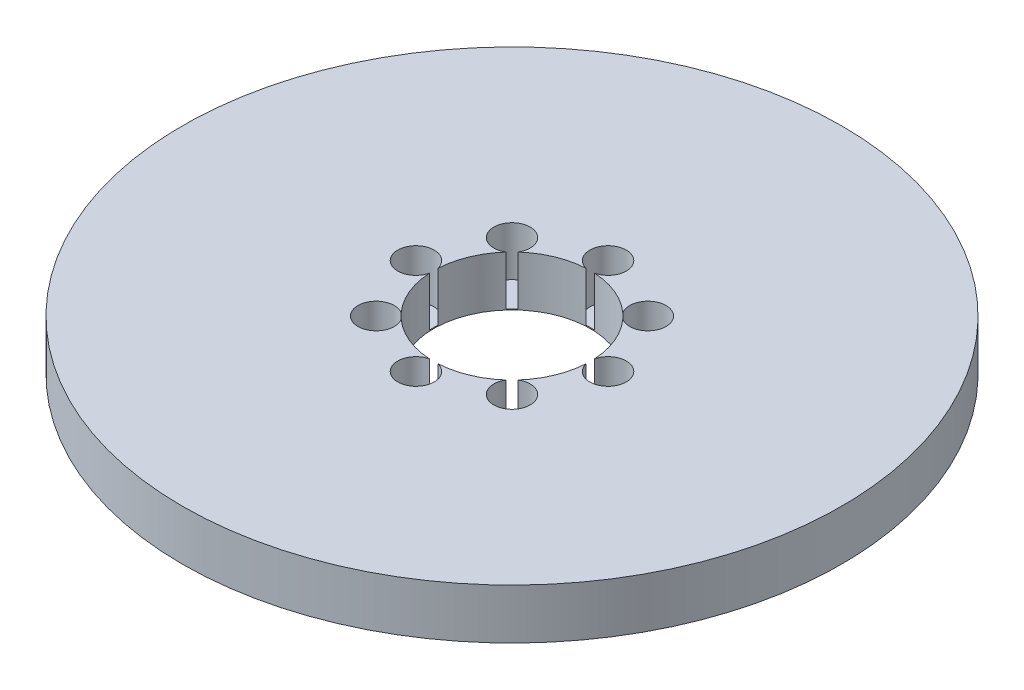
ISO-10303-21;
HEADER;
FILE_DESCRIPTION(('STEP AP214'),'2;1');
FILE_NAME('part.step','',(''),(''),'','','');
FILE_SCHEMA(('AUTOMOTIVE_DESIGN { 1 0 10303 214 1 1 1 1 }'));
ENDSEC;
DATA;
#1=APPLICATION_CONTEXT('core data for automotive mechanical design processes');
#2=APPLICATION_PROTOCOL_DEFINITION('international standard','automotive_design',2000,#1);
#3=PRODUCT_CONTEXT('',#1,'mechanical');
#4=PRODUCT('Part','Part','',(#3));
#5=PRODUCT_RELATED_PRODUCT_CATEGORY('part','',(#4));
#6=PRODUCT_DEFINITION_FORMATION('','',#4);
#7=PRODUCT_DEFINITION_CONTEXT('part definition',#1,'design');
#8=PRODUCT_DEFINITION('design','',#6,#7);
#9=PRODUCT_DEFINITION_SHAPE('','',#8);
#10=(LENGTH_UNIT() NAMED_UNIT(*) SI_UNIT(.MILLI.,.METRE.));
#11=(NAMED_UNIT(*) PLANE_ANGLE_UNIT() SI_UNIT($,.RADIAN.));
#12=(NAMED_UNIT(*) SI_UNIT($,.STERADIAN.) SOLID_ANGLE_UNIT());
#13=UNCERTAINTY_MEASURE_WITH_UNIT(LENGTH_MEASURE(1.E-05),#10,'distance_accuracy_value','');
#14=(GEOMETRIC_REPRESENTATION_CONTEXT(3) GLOBAL_UNCERTAINTY_ASSIGNED_CONTEXT((#13)) GLOBAL_UNIT_ASSIGNED_CONTEXT((#10,
#11,#12)) REPRESENTATION_CONTEXT('',''));
#15=CARTESIAN_POINT('',(0.,0.,0.));
#16=DIRECTION('',(0.,0.,1.));
#17=DIRECTION('',(1.,0.,0.));
#18=AXIS2_PLACEMENT_3D('',#15,#16,#17);
#19=CARTESIAN_POINT('',(0.,8.,0.));
#20=DIRECTION('',(0.,-1.,0.));
#21=DIRECTION('',(0.,0.,-1.));
#22=AXIS2_PLACEMENT_3D('',#19,#20,#21);
#23=CYLINDRICAL_SURFACE('',#22,52.5);
#24=CARTESIAN_POINT('',(0.,8.,0.));
#25=DIRECTION('',(0.,1.,0.));
#26=DIRECTION('',(0.,0.,1.));
#27=AXIS2_PLACEMENT_3D('',#24,#25,#26);
#28=CIRCLE('',#27,52.5);
#29=CARTESIAN_POINT('',(0.,8.,52.5));
#30=VERTEX_POINT('',#29);
#31=EDGE_CURVE('E195',#30,#30,#28,.T.);
#32=ORIENTED_EDGE('',*,*,#31,.F.);
#33=EDGE_LOOP('',(#32));
#34=FACE_BOUND('',#33,.T.);
#35=CARTESIAN_POINT('',(0.,0.,0.));
#36=DIRECTION('',(0.,1.,0.));
#37=DIRECTION('',(0.,0.,1.));
#38=AXIS2_PLACEMENT_3D('',#35,#36,#37);
#39=CIRCLE('',#38,52.5);
#40=CARTESIAN_POINT('',(0.,0.,52.5));
#41=VERTEX_POINT('',#40);
#42=EDGE_CURVE('E179',#41,#41,#39,.T.);
#43=ORIENTED_EDGE('',*,*,#42,.T.);
#44=EDGE_LOOP('',(#43));
#45=FACE_BOUND('',#44,.T.);
#46=ADVANCED_FACE('F39',(#34,#45),#23,.T.);
#47=CARTESIAN_POINT('',(0.,8.,0.));
#48=DIRECTION('',(0.,1.,0.));
#49=DIRECTION('',(0.,0.,1.));
#50=AXIS2_PLACEMENT_3D('',#47,#48,#49);
#51=PLANE('',#50);
#52=CARTESIAN_POINT('',(0.,8.,15.3054688065765));
#53=DIRECTION('',(0.,1.,0.));
#54=DIRECTION('',(1.,0.,0.));
#55=AXIS2_PLACEMENT_3D('',#52,#53,#54);
#56=CIRCLE('',#55,2.89889359926695);
#57=CARTESIAN_POINT('',(-0.65950036807734,8.,12.4825902465997));
#58=VERTEX_POINT('',#57);
#59=CARTESIAN_POINT('',(0.659500368077427,8.,12.4825902465997));
#60=VERTEX_POINT('',#59);
#61=EDGE_CURVE('E176',#58,#60,#56,.T.);
#62=ORIENTED_EDGE('',*,*,#61,.F.);
#63=CARTESIAN_POINT('',(0.,8.,0.));
#64=DIRECTION('',(0.,1.,0.));
#65=DIRECTION('',(0.,0.,1.));
#66=AXIS2_PLACEMENT_3D('',#63,#64,#65);
#67=CIRCLE('',#66,12.5);
#68=CARTESIAN_POINT('',(-8.36018702768115,8.,9.29286139260626));
#69=VERTEX_POINT('',#68);
#70=EDGE_CURVE('E166',#69,#58,#67,.T.);
#71=ORIENTED_EDGE('',*,*,#70,.F.);
#72=CARTESIAN_POINT('',(-10.8226007823694,8.,10.8226007823694));
#73=DIRECTION('',(0.,1.,0.));
#74=DIRECTION('',(0.707106781186549,0.,0.707106781186546));
#75=AXIS2_PLACEMENT_3D('',#72,#73,#74);
#76=CIRCLE('',#75,2.89889359926695);
#77=CARTESIAN_POINT('',(-9.29286139260623,8.,8.36018702768118));
#78=VERTEX_POINT('',#77);
#79=EDGE_CURVE('E147',#78,#69,#76,.T.);
#80=ORIENTED_EDGE('',*,*,#79,.F.);
#81=CARTESIAN_POINT('',(-12.4825902465997,8.,0.659500368077384));
#82=VERTEX_POINT('',#81);
#83=EDGE_CURVE('E180',#82,#78,#67,.T.);
#84=ORIENTED_EDGE('',*,*,#83,.F.);
#85=CARTESIAN_POINT('',(-15.3054688065765,8.,0.));
#86=DIRECTION('',(0.,1.,0.));
#87=DIRECTION('',(0.,0.,1.));
#88=AXIS2_PLACEMENT_3D('',#85,#86,#87);
#89=CIRCLE('',#88,2.89889359926695);
#90=CARTESIAN_POINT('',(-12.4825902465997,8.,-0.659500368077384));
#91=VERTEX_POINT('',#90);
#92=EDGE_CURVE('E186',#91,#82,#89,.T.);
#93=ORIENTED_EDGE('',*,*,#92,.F.);
#94=CARTESIAN_POINT('',(-9.29286139260635,8.,-8.36018702768104));
#95=VERTEX_POINT('',#94);
#96=EDGE_CURVE('E182',#95,#91,#67,.T.);
#97=ORIENTED_EDGE('',*,*,#96,.F.);
#98=CARTESIAN_POINT('',(-10.8226007823695,8.,-10.8226007823693));
#99=DIRECTION('',(0.,1.,0.));
#100=DIRECTION('',(-0.707106781186539,0.,0.707106781186556));
#101=AXIS2_PLACEMENT_3D('',#98,#99,#100);
#102=CIRCLE('',#101,2.89889359926695);
#103=CARTESIAN_POINT('',(-8.36018702768127,8.,-9.29286139260615));
#104=VERTEX_POINT('',#103);
#105=EDGE_CURVE('E446',#104,#95,#102,.T.);
#106=ORIENTED_EDGE('',*,*,#105,.F.);
#107=CARTESIAN_POINT('',(-0.659500368077514,8.,-12.4825902465997));
#108=VERTEX_POINT('',#107);
#109=EDGE_CURVE('E452',#108,#104,#67,.T.);
#110=ORIENTED_EDGE('',*,*,#109,.F.);
#111=CARTESIAN_POINT('',(-1.60316276161223E-13,8.,-15.3054688065765));
#112=DIRECTION('',(0.,1.,0.));
#113=DIRECTION('',(-1.,0.,0.));
#114=AXIS2_PLACEMENT_3D('',#111,#112,#113);
#115=CIRCLE('',#114,2.89889359926695);
#116=CARTESIAN_POINT('',(0.659500368077253,8.,-12.4825902465997));
#117=VERTEX_POINT('',#116);
#118=EDGE_CURVE('E477',#117,#108,#115,.T.);
#119=ORIENTED_EDGE('',*,*,#118,.F.);
#120=CARTESIAN_POINT('',(8.36018702768108,8.,-9.29286139260632));
#121=VERTEX_POINT('',#120);
#122=EDGE_CURVE('E460',#121,#117,#67,.T.);
#123=ORIENTED_EDGE('',*,*,#122,.F.);
#124=CARTESIAN_POINT('',(10.8226007823693,8.,-10.8226007823695));
#125=DIRECTION('',(0.,1.,0.));
#126=DIRECTION('',(-0.707106781186554,0.,-0.707106781186541));
#127=AXIS2_PLACEMENT_3D('',#124,#125,#126);
#128=CIRCLE('',#127,2.89889359926695);
#129=CARTESIAN_POINT('',(9.29286139260617,8.,-8.36018702768124));
#130=VERTEX_POINT('',#129);
#131=EDGE_CURVE('E464',#130,#121,#128,.T.);
#132=ORIENTED_EDGE('',*,*,#131,.F.);
#133=CARTESIAN_POINT('',(12.4825902465997,8.,-0.659500368077384));
#134=VERTEX_POINT('',#133);
#135=EDGE_CURVE('E459',#134,#130,#67,.T.);
#136=ORIENTED_EDGE('',*,*,#135,.F.);
#137=CARTESIAN_POINT('',(15.3054688065765,8.,0.));
#138=DIRECTION('',(0.,1.,0.));
#139=DIRECTION('',(0.,0.,-1.));
#140=AXIS2_PLACEMENT_3D('',#137,#138,#139);
#141=CIRCLE('',#140,2.89889359926695);
#142=CARTESIAN_POINT('',(12.4825902465997,8.,0.659500368077384));
#143=VERTEX_POINT('',#142);
#144=EDGE_CURVE('E469',#143,#134,#141,.T.);
#145=ORIENTED_EDGE('',*,*,#144,.F.);
#146=CARTESIAN_POINT('',(9.2928613926063,8.,8.36018702768111));
#147=VERTEX_POINT('',#146);
#148=EDGE_CURVE('E181',#147,#143,#67,.T.);
#149=ORIENTED_EDGE('',*,*,#148,.F.);
#150=CARTESIAN_POINT('',(10.8226007823695,8.,10.8226007823694));
#151=DIRECTION('',(0.,1.,0.));
#152=DIRECTION('',(0.707106781186544,0.,-0.707106781186551));
#153=AXIS2_PLACEMENT_3D('',#150,#151,#152);
#154=CIRCLE('',#153,2.89889359926695);
#155=CARTESIAN_POINT('',(8.3601870276812,8.,9.29286139260621));
#156=VERTEX_POINT('',#155);
#157=EDGE_CURVE('E475',#156,#147,#154,.T.);
#158=ORIENTED_EDGE('',*,*,#157,.F.);
#159=EDGE_CURVE('E177',#60,#156,#67,.T.);
#160=ORIENTED_EDGE('',*,*,#159,.F.);
#161=EDGE_LOOP('',(#62,#71,#80,#84,#93,#97,#106,#110,#119,#123,#132,#136,#145,#149,#158,#160));
#162=FACE_BOUND('',#161,.T.);
#163=ORIENTED_EDGE('',*,*,#31,.T.);
#164=EDGE_LOOP('',(#163));
#165=FACE_BOUND('',#164,.T.);
#166=ADVANCED_FACE('F172',(#162,#165),#51,.T.);
#167=CARTESIAN_POINT('',(0.,0.,0.));
#168=DIRECTION('',(0.,1.,0.));
#169=DIRECTION('',(0.,0.,1.));
#170=AXIS2_PLACEMENT_3D('',#167,#168,#169);
#171=PLANE('',#170);
#172=CARTESIAN_POINT('',(0.,0.,0.));
#173=DIRECTION('',(0.,1.,0.));
#174=DIRECTION('',(0.,0.,1.));
#175=AXIS2_PLACEMENT_3D('',#172,#173,#174);
#176=CIRCLE('',#175,12.5);
#177=CARTESIAN_POINT('',(0.,0.,12.5));
#178=VERTEX_POINT('',#177);
#179=EDGE_CURVE('E187',#178,#178,#176,.T.);
#180=ORIENTED_EDGE('',*,*,#179,.T.);
#181=EDGE_LOOP('',(#180));
#182=FACE_BOUND('',#181,.T.);
#183=ORIENTED_EDGE('',*,*,#42,.F.);
#184=EDGE_LOOP('',(#183));
#185=FACE_BOUND('',#184,.T.);
#186=ADVANCED_FACE('F270',(#182,#185),#171,.F.);
#187=CARTESIAN_POINT('',(0.,8.,0.));
#188=DIRECTION('',(0.,-1.,0.));
#189=DIRECTION('',(0.,0.,-1.));
#190=AXIS2_PLACEMENT_3D('',#187,#188,#189);
#191=CYLINDRICAL_SURFACE('',#190,12.5);
#192=DIRECTION('',(0.,1.,0.));
#193=VECTOR('',#192,1.);
#194=CARTESIAN_POINT('',(-0.659500368077356,4.07481042956162,12.4825902465997));
#195=LINE('',#194,#193);
#196=CARTESIAN_POINT('',(-0.65950036807734,0.149620859123241,12.4825902465997));
#197=VERTEX_POINT('',#196);
#198=EDGE_CURVE('E11',#197,#58,#195,.T.);
#199=ORIENTED_EDGE('',*,*,#198,.F.);
#200=CARTESIAN_POINT('',(0.,0.149620859123241,0.));
#201=DIRECTION('',(0.,1.,0.));
#202=DIRECTION('',(0.,0.,1.));
#203=AXIS2_PLACEMENT_3D('',#200,#201,#202);
#204=CIRCLE('',#203,12.5);
#205=CARTESIAN_POINT('',(0.659500368077427,0.149620859123241,12.4825902465997));
#206=VERTEX_POINT('',#205);
#207=EDGE_CURVE('E250',#197,#206,#204,.T.);
#208=ORIENTED_EDGE('',*,*,#207,.T.);
#209=DIRECTION('',(0.,1.,0.));
#210=VECTOR('',#209,1.);
#211=CARTESIAN_POINT('',(0.659500368077444,4.07481042956162,12.4825902465997));
#212=LINE('',#211,#210);
#213=EDGE_CURVE('E46',#60,#206,#212,.F.);
#214=ORIENTED_EDGE('',*,*,#213,.F.);
#215=ORIENTED_EDGE('',*,*,#159,.T.);
#216=DIRECTION('',(0.,1.,0.));
#217=VECTOR('',#216,1.);
#218=CARTESIAN_POINT('',(8.3601870276812,4.07481042956162,9.29286139260621));
#219=LINE('',#218,#217);
#220=CARTESIAN_POINT('',(8.3601870276812,0.149620859123241,9.29286139260621));
#221=VERTEX_POINT('',#220);
#222=EDGE_CURVE('E244',#221,#156,#219,.T.);
#223=ORIENTED_EDGE('',*,*,#222,.F.);
#224=CARTESIAN_POINT('',(0.,0.149620859123241,0.));
#225=DIRECTION('',(0.,1.,0.));
#226=DIRECTION('',(0.,0.,1.));
#227=AXIS2_PLACEMENT_3D('',#224,#225,#226);
#228=CIRCLE('',#227,12.5);
#229=CARTESIAN_POINT('',(9.2928613926063,0.149620859123241,8.36018702768111));
#230=VERTEX_POINT('',#229);
#231=EDGE_CURVE('E238',#221,#230,#228,.T.);
#232=ORIENTED_EDGE('',*,*,#231,.T.);
#233=DIRECTION('',(0.,1.,0.));
#234=VECTOR('',#233,1.);
#235=CARTESIAN_POINT('',(9.2928613926063,4.07481042956162,8.3601870276811));
#236=LINE('',#235,#234);
#237=EDGE_CURVE('E242',#147,#230,#236,.F.);
#238=ORIENTED_EDGE('',*,*,#237,.F.);
#239=ORIENTED_EDGE('',*,*,#148,.T.);
#240=DIRECTION('',(0.,1.,0.));
#241=VECTOR('',#240,1.);
#242=CARTESIAN_POINT('',(12.4825902465997,4.07481042956162,0.6595003680774));
#243=LINE('',#242,#241);
#244=CARTESIAN_POINT('',(12.4825902465997,0.149620859123241,0.659500368077384));
#245=VERTEX_POINT('',#244);
#246=EDGE_CURVE('E236',#245,#143,#243,.T.);
#247=ORIENTED_EDGE('',*,*,#246,.F.);
#248=CARTESIAN_POINT('',(0.,0.149620859123241,0.));
#249=DIRECTION('',(0.,1.,0.));
#250=DIRECTION('',(0.,0.,1.));
#251=AXIS2_PLACEMENT_3D('',#248,#249,#250);
#252=CIRCLE('',#251,12.5);
#253=CARTESIAN_POINT('',(12.4825902465997,0.149620859123241,-0.659500368077384));
#254=VERTEX_POINT('',#253);
#255=EDGE_CURVE('E235',#245,#254,#252,.T.);
#256=ORIENTED_EDGE('',*,*,#255,.T.);
#257=DIRECTION('',(0.,1.,0.));
#258=VECTOR('',#257,1.);
#259=CARTESIAN_POINT('',(12.4825902465997,4.07481042956162,-0.6595003680774));
#260=LINE('',#259,#258);
#261=EDGE_CURVE('E234',#134,#254,#260,.F.);
#262=ORIENTED_EDGE('',*,*,#261,.F.);
#263=ORIENTED_EDGE('',*,*,#135,.T.);
#264=DIRECTION('',(0.,1.,0.));
#265=VECTOR('',#264,1.);
#266=CARTESIAN_POINT('',(9.29286139260618,4.07481042956162,-8.36018702768123));
#267=LINE('',#266,#265);
#268=CARTESIAN_POINT('',(9.29286139260617,0.149620859123241,-8.36018702768124));
#269=VERTEX_POINT('',#268);
#270=EDGE_CURVE('E229',#269,#130,#267,.T.);
#271=ORIENTED_EDGE('',*,*,#270,.F.);
#272=CARTESIAN_POINT('',(0.,0.149620859123241,0.));
#273=DIRECTION('',(0.,1.,0.));
#274=DIRECTION('',(0.,0.,1.));
#275=AXIS2_PLACEMENT_3D('',#272,#273,#274);
#276=CIRCLE('',#275,12.5);
#277=CARTESIAN_POINT('',(8.36018702768108,0.149620859123241,-9.29286139260632));
#278=VERTEX_POINT('',#277);
#279=EDGE_CURVE('E221',#269,#278,#276,.T.);
#280=ORIENTED_EDGE('',*,*,#279,.T.);
#281=DIRECTION('',(0.,1.,0.));
#282=VECTOR('',#281,1.);
#283=CARTESIAN_POINT('',(8.36018702768107,4.07481042956162,-9.29286139260633));
#284=LINE('',#283,#282);
#285=EDGE_CURVE('E230',#121,#278,#284,.F.);
#286=ORIENTED_EDGE('',*,*,#285,.F.);
#287=ORIENTED_EDGE('',*,*,#122,.T.);
#288=DIRECTION('',(0.,1.,0.));
#289=VECTOR('',#288,1.);
#290=CARTESIAN_POINT('',(0.659500368077269,4.07481042956162,-12.4825902465997));
#291=LINE('',#290,#289);
#292=CARTESIAN_POINT('',(0.659500368077253,0.149620859123241,-12.4825902465997));
#293=VERTEX_POINT('',#292);
#294=EDGE_CURVE('E225',#293,#117,#291,.T.);
#295=ORIENTED_EDGE('',*,*,#294,.F.);
#296=CARTESIAN_POINT('',(0.,0.149620859123241,0.));
#297=DIRECTION('',(0.,1.,0.));
#298=DIRECTION('',(0.,0.,1.));
#299=AXIS2_PLACEMENT_3D('',#296,#297,#298);
#300=CIRCLE('',#299,12.5);
#301=CARTESIAN_POINT('',(-0.659500368077514,0.149620859123241,-12.4825902465997));
#302=VERTEX_POINT('',#301);
#303=EDGE_CURVE('E216',#293,#302,#300,.T.);
#304=ORIENTED_EDGE('',*,*,#303,.T.);
#305=DIRECTION('',(0.,1.,0.));
#306=VECTOR('',#305,1.);
#307=CARTESIAN_POINT('',(-0.65950036807753,4.07481042956162,-12.4825902465997));
#308=LINE('',#307,#306);
#309=EDGE_CURVE('E218',#108,#302,#308,.F.);
#310=ORIENTED_EDGE('',*,*,#309,.F.);
#311=ORIENTED_EDGE('',*,*,#109,.T.);
#312=DIRECTION('',(0.,1.,0.));
#313=VECTOR('',#312,1.);
#314=CARTESIAN_POINT('',(-8.36018702768127,4.07481042956162,-9.29286139260616));
#315=LINE('',#314,#313);
#316=CARTESIAN_POINT('',(-8.36018702768127,0.149620859123241,-9.29286139260615));
#317=VERTEX_POINT('',#316);
#318=EDGE_CURVE('E212',#317,#104,#315,.T.);
#319=ORIENTED_EDGE('',*,*,#318,.F.);
#320=CARTESIAN_POINT('',(0.,0.149620859123241,0.));
#321=DIRECTION('',(0.,1.,0.));
#322=DIRECTION('',(0.,0.,1.));
#323=AXIS2_PLACEMENT_3D('',#320,#321,#322);
#324=CIRCLE('',#323,12.5);
#325=CARTESIAN_POINT('',(-9.29286139260635,0.149620859123241,-8.36018702768104));
#326=VERTEX_POINT('',#325);
#327=EDGE_CURVE('E208',#317,#326,#324,.T.);
#328=ORIENTED_EDGE('',*,*,#327,.T.);
#329=DIRECTION('',(0.,1.,0.));
#330=VECTOR('',#329,1.);
#331=CARTESIAN_POINT('',(-9.29286139260636,4.07481042956162,-8.36018702768104));
#332=LINE('',#331,#330);
#333=EDGE_CURVE('E211',#95,#326,#332,.F.);
#334=ORIENTED_EDGE('',*,*,#333,.F.);
#335=ORIENTED_EDGE('',*,*,#96,.T.);
#336=DIRECTION('',(0.,1.,0.));
#337=VECTOR('',#336,1.);
#338=CARTESIAN_POINT('',(-12.4825902465997,4.07481042956162,-0.6595003680774));
#339=LINE('',#338,#337);
#340=CARTESIAN_POINT('',(-12.4825902465997,0.149620859123241,-0.659500368077384));
#341=VERTEX_POINT('',#340);
#342=EDGE_CURVE('E201',#341,#91,#339,.T.);
#343=ORIENTED_EDGE('',*,*,#342,.F.);
#344=CARTESIAN_POINT('',(0.,0.149620859123241,0.));
#345=DIRECTION('',(0.,1.,0.));
#346=DIRECTION('',(0.,0.,1.));
#347=AXIS2_PLACEMENT_3D('',#344,#345,#346);
#348=CIRCLE('',#347,12.5);
#349=CARTESIAN_POINT('',(-12.4825902465997,0.149620859123241,0.659500368077384));
#350=VERTEX_POINT('',#349);
#351=EDGE_CURVE('E194',#341,#350,#348,.T.);
#352=ORIENTED_EDGE('',*,*,#351,.T.);
#353=DIRECTION('',(0.,1.,0.));
#354=VECTOR('',#353,1.);
#355=CARTESIAN_POINT('',(-12.4825902465997,4.07481042956162,0.6595003680774));
#356=LINE('',#355,#354);
#357=EDGE_CURVE('E199',#82,#350,#356,.F.);
#358=ORIENTED_EDGE('',*,*,#357,.F.);
#359=ORIENTED_EDGE('',*,*,#83,.T.);
#360=DIRECTION('',(0.,1.,0.));
#361=VECTOR('',#360,1.);
#362=CARTESIAN_POINT('',(-9.29286139260624,4.07481042956162,8.36018702768117));
#363=LINE('',#362,#361);
#364=CARTESIAN_POINT('',(-9.29286139260623,0.149620859123241,8.36018702768118));
#365=VERTEX_POINT('',#364);
#366=EDGE_CURVE('E160',#365,#78,#363,.T.);
#367=ORIENTED_EDGE('',*,*,#366,.F.);
#368=CARTESIAN_POINT('',(0.,0.149620859123241,0.));
#369=DIRECTION('',(0.,1.,0.));
#370=DIRECTION('',(0.,0.,1.));
#371=AXIS2_PLACEMENT_3D('',#368,#369,#370);
#372=CIRCLE('',#371,12.5);
#373=CARTESIAN_POINT('',(-8.36018702768115,0.149620859123241,9.29286139260626));
#374=VERTEX_POINT('',#373);
#375=EDGE_CURVE('E168',#365,#374,#372,.T.);
#376=ORIENTED_EDGE('',*,*,#375,.T.);
#377=DIRECTION('',(0.,1.,0.));
#378=VECTOR('',#377,1.);
#379=CARTESIAN_POINT('',(-8.36018702768114,4.07481042956162,9.29286139260627));
#380=LINE('',#379,#378);
#381=EDGE_CURVE('E152',#69,#374,#380,.F.);
#382=ORIENTED_EDGE('',*,*,#381,.F.);
#383=ORIENTED_EDGE('',*,*,#70,.T.);
#384=EDGE_LOOP('',(#199,#208,#214,#215,#223,#232,#238,#239,#247,#256,#262,#263,#271,#280,#286,
#287,#295,#304,#310,#311,#319,#328,#334,#335,#343,#352,#358,#359,#367,#376,#382,#383));
#385=FACE_BOUND('',#384,.T.);
#386=ORIENTED_EDGE('',*,*,#179,.F.);
#387=EDGE_LOOP('',(#386));
#388=FACE_BOUND('',#387,.T.);
#389=ADVANCED_FACE('F170',(#385,#388),#191,.F.);
#390=CARTESIAN_POINT('',(-15.3054688065765,0.149620859123241,0.));
#391=DIRECTION('',(0.,1.,0.));
#392=DIRECTION('',(0.,0.,1.));
#393=AXIS2_PLACEMENT_3D('',#390,#391,#392);
#394=CYLINDRICAL_SURFACE('',#393,2.89889359926695);
#395=ORIENTED_EDGE('',*,*,#342,.T.);
#396=ORIENTED_EDGE('',*,*,#92,.T.);
#397=ORIENTED_EDGE('',*,*,#357,.T.);
#398=CARTESIAN_POINT('',(-15.3054688065765,0.149620859123241,0.));
#399=DIRECTION('',(0.,1.,0.));
#400=DIRECTION('',(0.,0.,1.));
#401=AXIS2_PLACEMENT_3D('',#398,#399,#400);
#402=CIRCLE('',#401,2.89889359926695);
#403=EDGE_CURVE('E191',#341,#350,#402,.T.);
#404=ORIENTED_EDGE('',*,*,#403,.F.);
#405=EDGE_LOOP('',(#395,#396,#397,#404));
#406=FACE_BOUND('',#405,.T.);
#407=ADVANCED_FACE('F279',(#406),#394,.F.);
#408=CARTESIAN_POINT('',(-15.3054688065765,0.149620859123241,0.));
#409=DIRECTION('',(0.,1.,0.));
#410=DIRECTION('',(0.,0.,1.));
#411=AXIS2_PLACEMENT_3D('',#408,#409,#410);
#412=PLANE('',#411);
#413=ORIENTED_EDGE('',*,*,#403,.T.);
#414=ORIENTED_EDGE('',*,*,#351,.F.);
#415=EDGE_LOOP('',(#413,#414));
#416=FACE_BOUND('',#415,.T.);
#417=ADVANCED_FACE('F285',(#416),#412,.T.);
#418=CARTESIAN_POINT('',(-10.8226007823694,0.149620859123241,10.8226007823694));
#419=DIRECTION('',(0.,1.,0.));
#420=DIRECTION('',(0.,0.,1.));
#421=AXIS2_PLACEMENT_3D('',#418,#419,#420);
#422=CYLINDRICAL_SURFACE('',#421,2.89889359926695);
#423=ORIENTED_EDGE('',*,*,#366,.T.);
#424=ORIENTED_EDGE('',*,*,#79,.T.);
#425=ORIENTED_EDGE('',*,*,#381,.T.);
#426=CARTESIAN_POINT('',(-10.8226007823694,0.149620859123241,10.8226007823694));
#427=DIRECTION('',(0.,1.,0.));
#428=DIRECTION('',(0.707106781186549,0.,0.707106781186546));
#429=AXIS2_PLACEMENT_3D('',#426,#427,#428);
#430=CIRCLE('',#429,2.89889359926695);
#431=EDGE_CURVE('E165',#365,#374,#430,.T.);
#432=ORIENTED_EDGE('',*,*,#431,.F.);
#433=EDGE_LOOP('',(#423,#424,#425,#432));
#434=FACE_BOUND('',#433,.T.);
#435=ADVANCED_FACE('F155',(#434),#422,.F.);
#436=CARTESIAN_POINT('',(-10.8226007823694,0.149620859123241,10.8226007823694));
#437=DIRECTION('',(0.,1.,0.));
#438=DIRECTION('',(0.707106781186549,0.,0.707106781186546));
#439=AXIS2_PLACEMENT_3D('',#436,#437,#438);
#440=PLANE('',#439);
#441=ORIENTED_EDGE('',*,*,#431,.T.);
#442=ORIENTED_EDGE('',*,*,#375,.F.);
#443=EDGE_LOOP('',(#441,#442));
#444=FACE_BOUND('',#443,.T.);
#445=ADVANCED_FACE('F288',(#444),#440,.T.);
#446=CARTESIAN_POINT('',(-10.8226007823695,0.149620859123241,-10.8226007823693));
#447=DIRECTION('',(0.,1.,0.));
#448=DIRECTION('',(0.,0.,1.));
#449=AXIS2_PLACEMENT_3D('',#446,#447,#448);
#450=CYLINDRICAL_SURFACE('',#449,2.89889359926695);
#451=ORIENTED_EDGE('',*,*,#318,.T.);
#452=ORIENTED_EDGE('',*,*,#105,.T.);
#453=ORIENTED_EDGE('',*,*,#333,.T.);
#454=CARTESIAN_POINT('',(-10.8226007823695,0.149620859123241,-10.8226007823693));
#455=DIRECTION('',(0.,1.,0.));
#456=DIRECTION('',(-0.707106781186539,0.,0.707106781186556));
#457=AXIS2_PLACEMENT_3D('',#454,#455,#456);
#458=CIRCLE('',#457,2.89889359926695);
#459=EDGE_CURVE('E447',#317,#326,#458,.T.);
#460=ORIENTED_EDGE('',*,*,#459,.F.);
#461=EDGE_LOOP('',(#451,#452,#453,#460));
#462=FACE_BOUND('',#461,.T.);
#463=ADVANCED_FACE('F295',(#462),#450,.F.);
#464=CARTESIAN_POINT('',(-10.8226007823695,0.149620859123241,-10.8226007823693));
#465=DIRECTION('',(0.,1.,0.));
#466=DIRECTION('',(-0.707106781186539,0.,0.707106781186556));
#467=AXIS2_PLACEMENT_3D('',#464,#465,#466);
#468=PLANE('',#467);
#469=ORIENTED_EDGE('',*,*,#459,.T.);
#470=ORIENTED_EDGE('',*,*,#327,.F.);
#471=EDGE_LOOP('',(#469,#470));
#472=FACE_BOUND('',#471,.T.);
#473=ADVANCED_FACE('F375',(#472),#468,.T.);
#474=CARTESIAN_POINT('',(-1.60316276161223E-13,0.149620859123241,-15.3054688065765));
#475=DIRECTION('',(0.,1.,0.));
#476=DIRECTION('',(0.,0.,1.));
#477=AXIS2_PLACEMENT_3D('',#474,#475,#476);
#478=CYLINDRICAL_SURFACE('',#477,2.89889359926695);
#479=ORIENTED_EDGE('',*,*,#294,.T.);
#480=ORIENTED_EDGE('',*,*,#118,.T.);
#481=ORIENTED_EDGE('',*,*,#309,.T.);
#482=CARTESIAN_POINT('',(-1.60316276161223E-13,0.149620859123241,-15.3054688065765));
#483=DIRECTION('',(0.,1.,0.));
#484=DIRECTION('',(-1.,0.,0.));
#485=AXIS2_PLACEMENT_3D('',#482,#483,#484);
#486=CIRCLE('',#485,2.89889359926695);
#487=EDGE_CURVE('E467',#293,#302,#486,.T.);
#488=ORIENTED_EDGE('',*,*,#487,.F.);
#489=EDGE_LOOP('',(#479,#480,#481,#488));
#490=FACE_BOUND('',#489,.T.);
#491=ADVANCED_FACE('F361',(#490),#478,.F.);
#492=CARTESIAN_POINT('',(-1.60316276161223E-13,0.149620859123241,-15.3054688065765));
#493=DIRECTION('',(0.,1.,0.));
#494=DIRECTION('',(-1.,0.,0.));
#495=AXIS2_PLACEMENT_3D('',#492,#493,#494);
#496=PLANE('',#495);
#497=ORIENTED_EDGE('',*,*,#487,.T.);
#498=ORIENTED_EDGE('',*,*,#303,.F.);
#499=EDGE_LOOP('',(#497,#498));
#500=FACE_BOUND('',#499,.T.);
#501=ADVANCED_FACE('F297',(#500),#496,.T.);
#502=CARTESIAN_POINT('',(10.8226007823693,0.149620859123241,-10.8226007823695));
#503=DIRECTION('',(0.,1.,0.));
#504=DIRECTION('',(0.,0.,1.));
#505=AXIS2_PLACEMENT_3D('',#502,#503,#504);
#506=CYLINDRICAL_SURFACE('',#505,2.89889359926695);
#507=ORIENTED_EDGE('',*,*,#270,.T.);
#508=ORIENTED_EDGE('',*,*,#131,.T.);
#509=ORIENTED_EDGE('',*,*,#285,.T.);
#510=CARTESIAN_POINT('',(10.8226007823693,0.149620859123241,-10.8226007823695));
#511=DIRECTION('',(0.,1.,0.));
#512=DIRECTION('',(-0.707106781186554,0.,-0.707106781186541));
#513=AXIS2_PLACEMENT_3D('',#510,#511,#512);
#514=CIRCLE('',#513,2.89889359926695);
#515=EDGE_CURVE('E470',#269,#278,#514,.T.);
#516=ORIENTED_EDGE('',*,*,#515,.F.);
#517=EDGE_LOOP('',(#507,#508,#509,#516));
#518=FACE_BOUND('',#517,.T.);
#519=ADVANCED_FACE('F294',(#518),#506,.F.);
#520=CARTESIAN_POINT('',(10.8226007823693,0.149620859123241,-10.8226007823695));
#521=DIRECTION('',(0.,1.,0.));
#522=DIRECTION('',(-0.707106781186554,0.,-0.707106781186541));
#523=AXIS2_PLACEMENT_3D('',#520,#521,#522);
#524=PLANE('',#523);
#525=ORIENTED_EDGE('',*,*,#515,.T.);
#526=ORIENTED_EDGE('',*,*,#279,.F.);
#527=EDGE_LOOP('',(#525,#526));
#528=FACE_BOUND('',#527,.T.);
#529=ADVANCED_FACE('F300',(#528),#524,.T.);
#530=CARTESIAN_POINT('',(15.3054688065765,0.149620859123241,0.));
#531=DIRECTION('',(0.,1.,0.));
#532=DIRECTION('',(0.,0.,1.));
#533=AXIS2_PLACEMENT_3D('',#530,#531,#532);
#534=CYLINDRICAL_SURFACE('',#533,2.89889359926695);
#535=ORIENTED_EDGE('',*,*,#246,.T.);
#536=ORIENTED_EDGE('',*,*,#144,.T.);
#537=ORIENTED_EDGE('',*,*,#261,.T.);
#538=CARTESIAN_POINT('',(15.3054688065765,0.149620859123241,0.));
#539=DIRECTION('',(0.,1.,0.));
#540=DIRECTION('',(0.,0.,-1.));
#541=AXIS2_PLACEMENT_3D('',#538,#539,#540);
#542=CIRCLE('',#541,2.89889359926695);
#543=EDGE_CURVE('E472',#245,#254,#542,.T.);
#544=ORIENTED_EDGE('',*,*,#543,.F.);
#545=EDGE_LOOP('',(#535,#536,#537,#544));
#546=FACE_BOUND('',#545,.T.);
#547=ADVANCED_FACE('F305',(#546),#534,.F.);
#548=CARTESIAN_POINT('',(15.3054688065765,0.149620859123241,0.));
#549=DIRECTION('',(0.,1.,0.));
#550=DIRECTION('',(0.,0.,-1.));
#551=AXIS2_PLACEMENT_3D('',#548,#549,#550);
#552=PLANE('',#551);
#553=ORIENTED_EDGE('',*,*,#543,.T.);
#554=ORIENTED_EDGE('',*,*,#255,.F.);
#555=EDGE_LOOP('',(#553,#554));
#556=FACE_BOUND('',#555,.T.);
#557=ADVANCED_FACE('F308',(#556),#552,.T.);
#558=CARTESIAN_POINT('',(10.8226007823695,0.149620859123241,10.8226007823694));
#559=DIRECTION('',(0.,1.,0.));
#560=DIRECTION('',(0.,0.,1.));
#561=AXIS2_PLACEMENT_3D('',#558,#559,#560);
#562=CYLINDRICAL_SURFACE('',#561,2.89889359926695);
#563=ORIENTED_EDGE('',*,*,#222,.T.);
#564=ORIENTED_EDGE('',*,*,#157,.T.);
#565=ORIENTED_EDGE('',*,*,#237,.T.);
#566=CARTESIAN_POINT('',(10.8226007823695,0.149620859123241,10.8226007823694));
#567=DIRECTION('',(0.,1.,0.));
#568=DIRECTION('',(0.707106781186544,0.,-0.707106781186551));
#569=AXIS2_PLACEMENT_3D('',#566,#567,#568);
#570=CIRCLE('',#569,2.89889359926695);
#571=EDGE_CURVE('E56',#221,#230,#570,.T.);
#572=ORIENTED_EDGE('',*,*,#571,.F.);
#573=EDGE_LOOP('',(#563,#564,#565,#572));
#574=FACE_BOUND('',#573,.T.);
#575=ADVANCED_FACE('F309',(#574),#562,.F.);
#576=CARTESIAN_POINT('',(10.8226007823695,0.149620859123241,10.8226007823694));
#577=DIRECTION('',(0.,1.,0.));
#578=DIRECTION('',(0.707106781186544,0.,-0.707106781186551));
#579=AXIS2_PLACEMENT_3D('',#576,#577,#578);
#580=PLANE('',#579);
#581=ORIENTED_EDGE('',*,*,#571,.T.);
#582=ORIENTED_EDGE('',*,*,#231,.F.);
#583=EDGE_LOOP('',(#581,#582));
#584=FACE_BOUND('',#583,.T.);
#585=ADVANCED_FACE('F256',(#584),#580,.T.);
#586=CARTESIAN_POINT('',(0.,0.149620859123241,15.3054688065765));
#587=DIRECTION('',(0.,1.,0.));
#588=DIRECTION('',(0.,0.,1.));
#589=AXIS2_PLACEMENT_3D('',#586,#587,#588);
#590=CYLINDRICAL_SURFACE('',#589,2.89889359926695);
#591=ORIENTED_EDGE('',*,*,#198,.T.);
#592=ORIENTED_EDGE('',*,*,#61,.T.);
#593=ORIENTED_EDGE('',*,*,#213,.T.);
#594=CARTESIAN_POINT('',(0.,0.149620859123241,15.3054688065765));
#595=DIRECTION('',(0.,1.,0.));
#596=DIRECTION('',(1.,0.,0.));
#597=AXIS2_PLACEMENT_3D('',#594,#595,#596);
#598=CIRCLE('',#597,2.89889359926695);
#599=EDGE_CURVE('E55',#197,#206,#598,.T.);
#600=ORIENTED_EDGE('',*,*,#599,.F.);
#601=EDGE_LOOP('',(#591,#592,#593,#600));
#602=FACE_BOUND('',#601,.T.);
#603=ADVANCED_FACE('F253',(#602),#590,.F.);
#604=CARTESIAN_POINT('',(0.,0.149620859123241,15.3054688065765));
#605=DIRECTION('',(0.,1.,0.));
#606=DIRECTION('',(1.,0.,0.));
#607=AXIS2_PLACEMENT_3D('',#604,#605,#606);
#608=PLANE('',#607);
#609=ORIENTED_EDGE('',*,*,#599,.T.);
#610=ORIENTED_EDGE('',*,*,#207,.F.);
#611=EDGE_LOOP('',(#609,#610));
#612=FACE_BOUND('',#611,.T.);
#613=ADVANCED_FACE('F252',(#612),#608,.T.);
#614=CLOSED_SHELL('',(#46,#166,#186,#389,#407,#417,#435,#445,#463,#473,#491,#501,#519,#529,#547,
#557,#575,#585,#603,#613));
#615=MANIFOLD_SOLID_BREP('B2',#614);
#616=ADVANCED_BREP_SHAPE_REPRESENTATION('',(#18,#615),#14);
#617=SHAPE_DEFINITION_REPRESENTATION(#9,#616);
ENDSEC;
END-ISO-10303-21;
